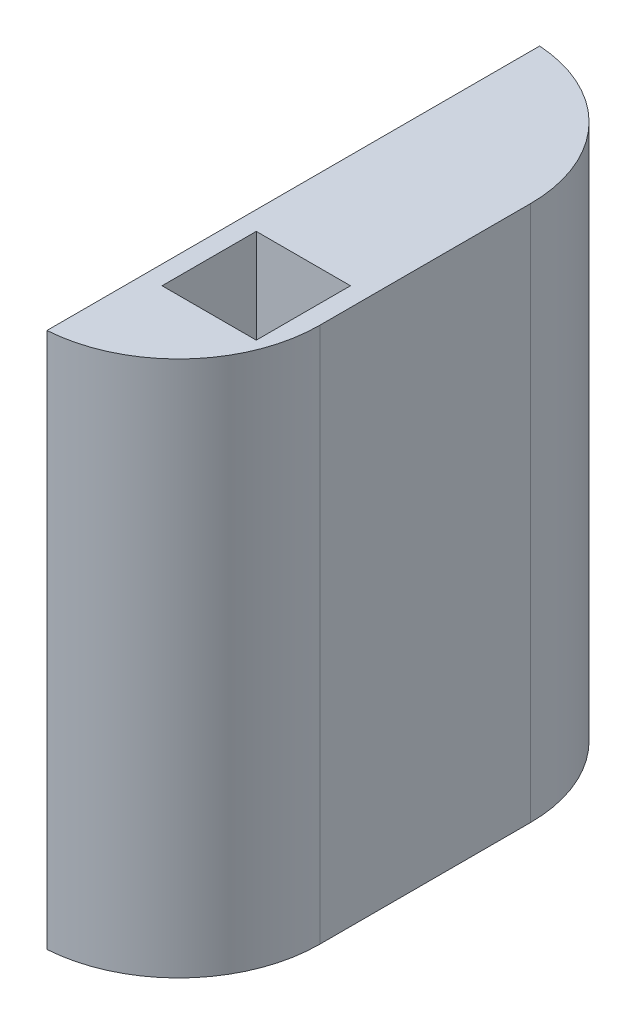
ISO-10303-21;
HEADER;
FILE_DESCRIPTION(('STEP AP214'),'2;1');
FILE_NAME('part.step','',(''),(''),'','','');
FILE_SCHEMA(('AUTOMOTIVE_DESIGN { 1 0 10303 214 1 1 1 1 }'));
ENDSEC;
DATA;
#1=APPLICATION_CONTEXT('core data for automotive mechanical design processes');
#2=APPLICATION_PROTOCOL_DEFINITION('international standard','automotive_design',2000,#1);
#3=PRODUCT_CONTEXT('',#1,'mechanical');
#4=PRODUCT('Part','Part','',(#3));
#5=PRODUCT_RELATED_PRODUCT_CATEGORY('part','',(#4));
#6=PRODUCT_DEFINITION_FORMATION('','',#4);
#7=PRODUCT_DEFINITION_CONTEXT('part definition',#1,'design');
#8=PRODUCT_DEFINITION('design','',#6,#7);
#9=PRODUCT_DEFINITION_SHAPE('','',#8);
#10=(LENGTH_UNIT() NAMED_UNIT(*) SI_UNIT(.MILLI.,.METRE.));
#11=(NAMED_UNIT(*) PLANE_ANGLE_UNIT() SI_UNIT($,.RADIAN.));
#12=(NAMED_UNIT(*) SI_UNIT($,.STERADIAN.) SOLID_ANGLE_UNIT());
#13=UNCERTAINTY_MEASURE_WITH_UNIT(LENGTH_MEASURE(1.E-05),#10,'distance_accuracy_value','');
#14=(GEOMETRIC_REPRESENTATION_CONTEXT(3) GLOBAL_UNCERTAINTY_ASSIGNED_CONTEXT((#13)) GLOBAL_UNIT_ASSIGNED_CONTEXT((#10,
#11,#12)) REPRESENTATION_CONTEXT('',''));
#15=CARTESIAN_POINT('',(0.,0.,0.));
#16=DIRECTION('',(0.,0.,1.));
#17=DIRECTION('',(1.,0.,0.));
#18=AXIS2_PLACEMENT_3D('',#15,#16,#17);
#19=CARTESIAN_POINT('',(0.,56.9,0.));
#20=DIRECTION('',(0.,1.,0.));
#21=DIRECTION('',(0.,0.,1.));
#22=AXIS2_PLACEMENT_3D('',#19,#20,#21);
#23=PLANE('',#22);
#24=DIRECTION('',(0.,0.,-1.));
#25=VECTOR('',#24,1.);
#26=CARTESIAN_POINT('',(7.,56.9,-26.15));
#27=LINE('',#26,#25);
#28=CARTESIAN_POINT('',(7.,56.9,11.1833704529042));
#29=VERTEX_POINT('',#28);
#30=CARTESIAN_POINT('',(7.,56.9,-11.1833704529042));
#31=VERTEX_POINT('',#30);
#32=EDGE_CURVE('E146',#29,#31,#27,.T.);
#33=ORIENTED_EDGE('',*,*,#32,.T.);
#34=CARTESIAN_POINT('',(-8.,56.9,-11.1833704529042));
#35=DIRECTION('',(0.,1.,0.));
#36=DIRECTION('',(0.,0.,1.));
#37=AXIS2_PLACEMENT_3D('',#34,#35,#36);
#38=CIRCLE('',#37,15.);
#39=CARTESIAN_POINT('',(-7.,56.9,-26.15));
#40=VERTEX_POINT('',#39);
#41=EDGE_CURVE('E12',#31,#40,#38,.T.);
#42=ORIENTED_EDGE('',*,*,#41,.T.);
#43=DIRECTION('',(0.,0.,1.));
#44=VECTOR('',#43,1.);
#45=CARTESIAN_POINT('',(-7.,56.9,-26.15));
#46=LINE('',#45,#44);
#47=CARTESIAN_POINT('',(-7.,56.9,26.15));
#48=VERTEX_POINT('',#47);
#49=EDGE_CURVE('E148',#40,#48,#46,.T.);
#50=ORIENTED_EDGE('',*,*,#49,.T.);
#51=CARTESIAN_POINT('',(-8.,56.9,11.1833704529042));
#52=DIRECTION('',(0.,1.,0.));
#53=DIRECTION('',(0.,0.,1.));
#54=AXIS2_PLACEMENT_3D('',#51,#52,#53);
#55=CIRCLE('',#54,15.);
#56=EDGE_CURVE('E165',#48,#29,#55,.T.);
#57=ORIENTED_EDGE('',*,*,#56,.T.);
#58=EDGE_LOOP('',(#33,#42,#50,#57));
#59=FACE_BOUND('',#58,.T.);
#60=DIRECTION('',(1.,0.,0.));
#61=VECTOR('',#60,1.);
#62=CARTESIAN_POINT('',(0.,56.9,5.93));
#63=LINE('',#62,#61);
#64=CARTESIAN_POINT('',(-5.,56.9,5.93));
#65=VERTEX_POINT('',#64);
#66=CARTESIAN_POINT('',(5.,56.9,5.93));
#67=VERTEX_POINT('',#66);
#68=EDGE_CURVE('E136',#65,#67,#63,.T.);
#69=ORIENTED_EDGE('',*,*,#68,.T.);
#70=DIRECTION('',(0.,0.,1.));
#71=VECTOR('',#70,1.);
#72=CARTESIAN_POINT('',(5.,56.9,0.));
#73=LINE('',#72,#71);
#74=CARTESIAN_POINT('',(5.,56.9,15.93));
#75=VERTEX_POINT('',#74);
#76=EDGE_CURVE('E121',#67,#75,#73,.T.);
#77=ORIENTED_EDGE('',*,*,#76,.T.);
#78=DIRECTION('',(1.,0.,0.));
#79=VECTOR('',#78,1.);
#80=CARTESIAN_POINT('',(0.,56.9,15.93));
#81=LINE('',#80,#79);
#82=CARTESIAN_POINT('',(-5.,56.9,15.93));
#83=VERTEX_POINT('',#82);
#84=EDGE_CURVE('E127',#83,#75,#81,.T.);
#85=ORIENTED_EDGE('',*,*,#84,.F.);
#86=DIRECTION('',(0.,0.,1.));
#87=VECTOR('',#86,1.);
#88=CARTESIAN_POINT('',(-5.,56.9,0.));
#89=LINE('',#88,#87);
#90=EDGE_CURVE('E130',#65,#83,#89,.T.);
#91=ORIENTED_EDGE('',*,*,#90,.F.);
#92=EDGE_LOOP('',(#69,#77,#85,#91));
#93=FACE_BOUND('',#92,.T.);
#94=ADVANCED_FACE('F38',(#59,#93),#23,.T.);
#95=CARTESIAN_POINT('',(0.,0.,0.));
#96=DIRECTION('',(0.,1.,0.));
#97=DIRECTION('',(0.,0.,1.));
#98=AXIS2_PLACEMENT_3D('',#95,#96,#97);
#99=PLANE('',#98);
#100=DIRECTION('',(0.,0.,1.));
#101=VECTOR('',#100,1.);
#102=CARTESIAN_POINT('',(-7.,0.,-26.15));
#103=LINE('',#102,#101);
#104=CARTESIAN_POINT('',(-7.,0.,-26.15));
#105=VERTEX_POINT('',#104);
#106=CARTESIAN_POINT('',(-7.,0.,26.15));
#107=VERTEX_POINT('',#106);
#108=EDGE_CURVE('E149',#105,#107,#103,.T.);
#109=ORIENTED_EDGE('',*,*,#108,.F.);
#110=CARTESIAN_POINT('',(-8.,0.,-11.1833704529042));
#111=DIRECTION('',(0.,1.,0.));
#112=DIRECTION('',(0.,0.,1.));
#113=AXIS2_PLACEMENT_3D('',#110,#111,#112);
#114=CIRCLE('',#113,15.);
#115=CARTESIAN_POINT('',(7.,0.,-11.1833704529042));
#116=VERTEX_POINT('',#115);
#117=EDGE_CURVE('E60',#105,#116,#114,.F.);
#118=ORIENTED_EDGE('',*,*,#117,.T.);
#119=DIRECTION('',(0.,0.,-1.));
#120=VECTOR('',#119,1.);
#121=CARTESIAN_POINT('',(7.,0.,-26.15));
#122=LINE('',#121,#120);
#123=CARTESIAN_POINT('',(7.,0.,11.1833704529042));
#124=VERTEX_POINT('',#123);
#125=EDGE_CURVE('E142',#124,#116,#122,.T.);
#126=ORIENTED_EDGE('',*,*,#125,.F.);
#127=CARTESIAN_POINT('',(-8.,0.,11.1833704529042));
#128=DIRECTION('',(0.,1.,0.));
#129=DIRECTION('',(0.,0.,1.));
#130=AXIS2_PLACEMENT_3D('',#127,#128,#129);
#131=CIRCLE('',#130,15.);
#132=EDGE_CURVE('E163',#124,#107,#131,.F.);
#133=ORIENTED_EDGE('',*,*,#132,.T.);
#134=EDGE_LOOP('',(#109,#118,#126,#133));
#135=FACE_BOUND('',#134,.T.);
#136=DIRECTION('',(0.,0.,1.));
#137=VECTOR('',#136,1.);
#138=CARTESIAN_POINT('',(5.,0.,0.));
#139=LINE('',#138,#137);
#140=CARTESIAN_POINT('',(5.,0.,5.93));
#141=VERTEX_POINT('',#140);
#142=CARTESIAN_POINT('',(5.,0.,15.93));
#143=VERTEX_POINT('',#142);
#144=EDGE_CURVE('E115',#141,#143,#139,.T.);
#145=ORIENTED_EDGE('',*,*,#144,.F.);
#146=DIRECTION('',(1.,0.,0.));
#147=VECTOR('',#146,1.);
#148=CARTESIAN_POINT('',(0.,0.,5.93));
#149=LINE('',#148,#147);
#150=CARTESIAN_POINT('',(-5.,0.,5.93));
#151=VERTEX_POINT('',#150);
#152=EDGE_CURVE('E104',#151,#141,#149,.T.);
#153=ORIENTED_EDGE('',*,*,#152,.F.);
#154=DIRECTION('',(0.,0.,1.));
#155=VECTOR('',#154,1.);
#156=CARTESIAN_POINT('',(-5.,0.,0.));
#157=LINE('',#156,#155);
#158=CARTESIAN_POINT('',(-5.,0.,15.93));
#159=VERTEX_POINT('',#158);
#160=EDGE_CURVE('E114',#151,#159,#157,.T.);
#161=ORIENTED_EDGE('',*,*,#160,.T.);
#162=DIRECTION('',(1.,0.,0.));
#163=VECTOR('',#162,1.);
#164=CARTESIAN_POINT('',(0.,0.,15.93));
#165=LINE('',#164,#163);
#166=EDGE_CURVE('E122',#159,#143,#165,.T.);
#167=ORIENTED_EDGE('',*,*,#166,.T.);
#168=EDGE_LOOP('',(#145,#153,#161,#167));
#169=FACE_BOUND('',#168,.T.);
#170=ADVANCED_FACE('F125',(#135,#169),#99,.F.);
#171=CARTESIAN_POINT('',(7.,56.9,-26.15));
#172=DIRECTION('',(-1.,0.,0.));
#173=DIRECTION('',(0.,0.,1.));
#174=AXIS2_PLACEMENT_3D('',#171,#172,#173);
#175=PLANE('',#174);
#176=ORIENTED_EDGE('',*,*,#125,.T.);
#177=DIRECTION('',(0.,1.,0.));
#178=VECTOR('',#177,1.);
#179=CARTESIAN_POINT('',(7.,56.9,-11.1833704529042));
#180=LINE('',#179,#178);
#181=EDGE_CURVE('E46',#116,#31,#180,.T.);
#182=ORIENTED_EDGE('',*,*,#181,.T.);
#183=ORIENTED_EDGE('',*,*,#32,.F.);
#184=DIRECTION('',(0.,-1.,0.));
#185=VECTOR('',#184,1.);
#186=CARTESIAN_POINT('',(7.,56.9,11.1833704529042));
#187=LINE('',#186,#185);
#188=EDGE_CURVE('E160',#29,#124,#187,.T.);
#189=ORIENTED_EDGE('',*,*,#188,.T.);
#190=EDGE_LOOP('',(#176,#182,#183,#189));
#191=FACE_BOUND('',#190,.T.);
#192=ADVANCED_FACE('F175',(#191),#175,.F.);
#193=CARTESIAN_POINT('',(-7.,56.9,-26.15));
#194=DIRECTION('',(1.,0.,0.));
#195=DIRECTION('',(0.,0.,-1.));
#196=AXIS2_PLACEMENT_3D('',#193,#194,#195);
#197=PLANE('',#196);
#198=ORIENTED_EDGE('',*,*,#108,.T.);
#199=DIRECTION('',(0.,-1.,0.));
#200=VECTOR('',#199,1.);
#201=CARTESIAN_POINT('',(-7.,56.9,26.15));
#202=LINE('',#201,#200);
#203=EDGE_CURVE('E151',#48,#107,#202,.T.);
#204=ORIENTED_EDGE('',*,*,#203,.F.);
#205=ORIENTED_EDGE('',*,*,#49,.F.);
#206=DIRECTION('',(0.,-1.,0.));
#207=VECTOR('',#206,1.);
#208=CARTESIAN_POINT('',(-7.,56.9,-26.15));
#209=LINE('',#208,#207);
#210=EDGE_CURVE('E157',#40,#105,#209,.T.);
#211=ORIENTED_EDGE('',*,*,#210,.T.);
#212=EDGE_LOOP('',(#198,#204,#205,#211));
#213=FACE_BOUND('',#212,.T.);
#214=ADVANCED_FACE('F178',(#213),#197,.F.);
#215=CARTESIAN_POINT('',(5.,0.,0.));
#216=DIRECTION('',(-1.,0.,0.));
#217=DIRECTION('',(0.,0.,1.));
#218=AXIS2_PLACEMENT_3D('',#215,#216,#217);
#219=PLANE('',#218);
#220=ORIENTED_EDGE('',*,*,#76,.F.);
#221=DIRECTION('',(0.,1.,0.));
#222=VECTOR('',#221,1.);
#223=CARTESIAN_POINT('',(5.,0.,5.93));
#224=LINE('',#223,#222);
#225=EDGE_CURVE('E108',#141,#67,#224,.T.);
#226=ORIENTED_EDGE('',*,*,#225,.F.);
#227=ORIENTED_EDGE('',*,*,#144,.T.);
#228=DIRECTION('',(0.,1.,0.));
#229=VECTOR('',#228,1.);
#230=CARTESIAN_POINT('',(5.,0.,15.93));
#231=LINE('',#230,#229);
#232=EDGE_CURVE('E140',#143,#75,#231,.T.);
#233=ORIENTED_EDGE('',*,*,#232,.T.);
#234=EDGE_LOOP('',(#220,#226,#227,#233));
#235=FACE_BOUND('',#234,.T.);
#236=ADVANCED_FACE('F118',(#235),#219,.T.);
#237=CARTESIAN_POINT('',(0.,0.,15.93));
#238=DIRECTION('',(0.,0.,1.));
#239=DIRECTION('',(1.,0.,0.));
#240=AXIS2_PLACEMENT_3D('',#237,#238,#239);
#241=PLANE('',#240);
#242=ORIENTED_EDGE('',*,*,#84,.T.);
#243=ORIENTED_EDGE('',*,*,#232,.F.);
#244=ORIENTED_EDGE('',*,*,#166,.F.);
#245=DIRECTION('',(0.,1.,0.));
#246=VECTOR('',#245,1.);
#247=CARTESIAN_POINT('',(-5.,0.,15.93));
#248=LINE('',#247,#246);
#249=EDGE_CURVE('E143',#159,#83,#248,.T.);
#250=ORIENTED_EDGE('',*,*,#249,.T.);
#251=EDGE_LOOP('',(#242,#243,#244,#250));
#252=FACE_BOUND('',#251,.T.);
#253=ADVANCED_FACE('F212',(#252),#241,.F.);
#254=CARTESIAN_POINT('',(-5.,0.,0.));
#255=DIRECTION('',(-1.,0.,0.));
#256=DIRECTION('',(0.,0.,1.));
#257=AXIS2_PLACEMENT_3D('',#254,#255,#256);
#258=PLANE('',#257);
#259=ORIENTED_EDGE('',*,*,#90,.T.);
#260=ORIENTED_EDGE('',*,*,#249,.F.);
#261=ORIENTED_EDGE('',*,*,#160,.F.);
#262=DIRECTION('',(0.,1.,0.));
#263=VECTOR('',#262,1.);
#264=CARTESIAN_POINT('',(-5.,0.,5.93));
#265=LINE('',#264,#263);
#266=EDGE_CURVE('E110',#151,#65,#265,.T.);
#267=ORIENTED_EDGE('',*,*,#266,.T.);
#268=EDGE_LOOP('',(#259,#260,#261,#267));
#269=FACE_BOUND('',#268,.T.);
#270=ADVANCED_FACE('F218',(#269),#258,.F.);
#271=CARTESIAN_POINT('',(0.,0.,5.93));
#272=DIRECTION('',(0.,0.,1.));
#273=DIRECTION('',(1.,0.,0.));
#274=AXIS2_PLACEMENT_3D('',#271,#272,#273);
#275=PLANE('',#274);
#276=ORIENTED_EDGE('',*,*,#68,.F.);
#277=ORIENTED_EDGE('',*,*,#266,.F.);
#278=ORIENTED_EDGE('',*,*,#152,.T.);
#279=ORIENTED_EDGE('',*,*,#225,.T.);
#280=EDGE_LOOP('',(#276,#277,#278,#279));
#281=FACE_BOUND('',#280,.T.);
#282=ADVANCED_FACE('F107',(#281),#275,.T.);
#283=CARTESIAN_POINT('',(-8.,56.9,11.1833704529042));
#284=DIRECTION('',(0.,-1.,0.));
#285=DIRECTION('',(0.,0.,-1.));
#286=AXIS2_PLACEMENT_3D('',#283,#284,#285);
#287=CYLINDRICAL_SURFACE('',#286,15.);
#288=ORIENTED_EDGE('',*,*,#56,.F.);
#289=ORIENTED_EDGE('',*,*,#203,.T.);
#290=ORIENTED_EDGE('',*,*,#132,.F.);
#291=ORIENTED_EDGE('',*,*,#188,.F.);
#292=EDGE_LOOP('',(#288,#289,#290,#291));
#293=FACE_BOUND('',#292,.T.);
#294=ADVANCED_FACE('F176',(#293),#287,.T.);
#295=CARTESIAN_POINT('',(-8.,56.9,-11.1833704529042));
#296=DIRECTION('',(0.,1.,0.));
#297=DIRECTION('',(0.,0.,1.));
#298=AXIS2_PLACEMENT_3D('',#295,#296,#297);
#299=CYLINDRICAL_SURFACE('',#298,15.);
#300=ORIENTED_EDGE('',*,*,#41,.F.);
#301=ORIENTED_EDGE('',*,*,#181,.F.);
#302=ORIENTED_EDGE('',*,*,#117,.F.);
#303=ORIENTED_EDGE('',*,*,#210,.F.);
#304=EDGE_LOOP('',(#300,#301,#302,#303));
#305=FACE_BOUND('',#304,.T.);
#306=ADVANCED_FACE('F40',(#305),#299,.T.);
#307=CLOSED_SHELL('',(#94,#170,#192,#214,#236,#253,#270,#282,#294,#306));
#308=MANIFOLD_SOLID_BREP('B2',#307);
#309=ADVANCED_BREP_SHAPE_REPRESENTATION('',(#18,#308),#14);
#310=SHAPE_DEFINITION_REPRESENTATION(#9,#309);
ENDSEC;
END-ISO-10303-21;
